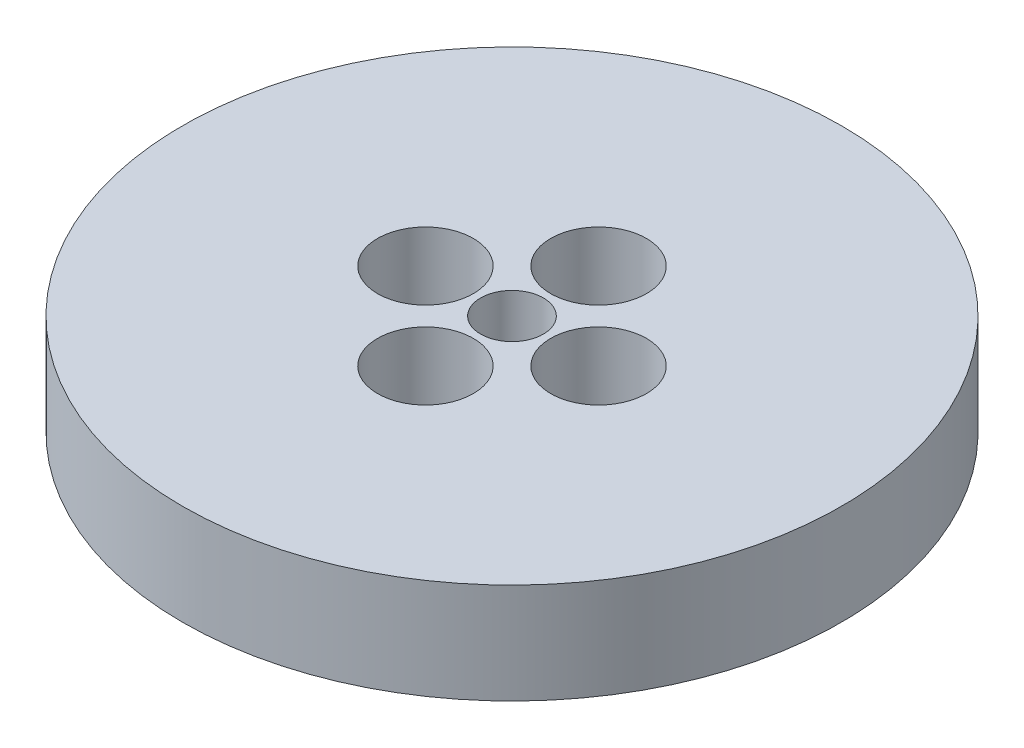
ISO-10303-21;
HEADER;
FILE_DESCRIPTION(('STEP AP214'),'2;1');
FILE_NAME('part.step','',(''),(''),'','','');
FILE_SCHEMA(('AUTOMOTIVE_DESIGN { 1 0 10303 214 1 1 1 1 }'));
ENDSEC;
DATA;
#1=APPLICATION_CONTEXT('core data for automotive mechanical design processes');
#2=APPLICATION_PROTOCOL_DEFINITION('international standard','automotive_design',2000,#1);
#3=PRODUCT_CONTEXT('',#1,'mechanical');
#4=PRODUCT('Part','Part','',(#3));
#5=PRODUCT_RELATED_PRODUCT_CATEGORY('part','',(#4));
#6=PRODUCT_DEFINITION_FORMATION('','',#4);
#7=PRODUCT_DEFINITION_CONTEXT('part definition',#1,'design');
#8=PRODUCT_DEFINITION('design','',#6,#7);
#9=PRODUCT_DEFINITION_SHAPE('','',#8);
#10=(LENGTH_UNIT() NAMED_UNIT(*) SI_UNIT(.MILLI.,.METRE.));
#11=(NAMED_UNIT(*) PLANE_ANGLE_UNIT() SI_UNIT($,.RADIAN.));
#12=(NAMED_UNIT(*) SI_UNIT($,.STERADIAN.) SOLID_ANGLE_UNIT());
#13=UNCERTAINTY_MEASURE_WITH_UNIT(LENGTH_MEASURE(1.E-05),#10,'distance_accuracy_value','');
#14=(GEOMETRIC_REPRESENTATION_CONTEXT(3) GLOBAL_UNCERTAINTY_ASSIGNED_CONTEXT((#13)) GLOBAL_UNIT_ASSIGNED_CONTEXT((#10,
#11,#12)) REPRESENTATION_CONTEXT('',''));
#15=CARTESIAN_POINT('',(0.,0.,0.));
#16=DIRECTION('',(0.,0.,1.));
#17=DIRECTION('',(1.,0.,0.));
#18=AXIS2_PLACEMENT_3D('',#15,#16,#17);
#19=CARTESIAN_POINT('',(0.,16.,0.));
#20=DIRECTION('',(0.,-1.,0.));
#21=DIRECTION('',(0.,0.,-1.));
#22=AXIS2_PLACEMENT_3D('',#19,#20,#21);
#23=CYLINDRICAL_SURFACE('',#22,52.5);
#24=CARTESIAN_POINT('',(0.,16.,0.));
#25=DIRECTION('',(0.,1.,0.));
#26=DIRECTION('',(0.,0.,1.));
#27=AXIS2_PLACEMENT_3D('',#24,#25,#26);
#28=CIRCLE('',#27,52.5);
#29=CARTESIAN_POINT('',(0.,16.,52.5));
#30=VERTEX_POINT('',#29);
#31=EDGE_CURVE('E10',#30,#30,#28,.T.);
#32=ORIENTED_EDGE('',*,*,#31,.F.);
#33=EDGE_LOOP('',(#32));
#34=FACE_BOUND('',#33,.T.);
#35=CARTESIAN_POINT('',(0.,0.,0.));
#36=DIRECTION('',(0.,1.,0.));
#37=DIRECTION('',(0.,0.,1.));
#38=AXIS2_PLACEMENT_3D('',#35,#36,#37);
#39=CIRCLE('',#38,52.5);
#40=CARTESIAN_POINT('',(0.,0.,52.5));
#41=VERTEX_POINT('',#40);
#42=EDGE_CURVE('E37',#41,#41,#39,.T.);
#43=ORIENTED_EDGE('',*,*,#42,.T.);
#44=EDGE_LOOP('',(#43));
#45=FACE_BOUND('',#44,.T.);
#46=ADVANCED_FACE('F40',(#34,#45),#23,.T.);
#47=CARTESIAN_POINT('',(0.,16.,0.));
#48=DIRECTION('',(0.,1.,0.));
#49=DIRECTION('',(0.,0.,1.));
#50=AXIS2_PLACEMENT_3D('',#47,#48,#49);
#51=PLANE('',#50);
#52=CARTESIAN_POINT('',(13.7886073295616,16.,0.));
#53=DIRECTION('',(0.,1.,0.));
#54=DIRECTION('',(0.,0.,-1.));
#55=AXIS2_PLACEMENT_3D('',#52,#53,#54);
#56=CIRCLE('',#55,7.62890674126943);
#57=CARTESIAN_POINT('',(13.7886073295616,16.,-7.62890674126943));
#58=VERTEX_POINT('',#57);
#59=EDGE_CURVE('E70',#58,#58,#56,.T.);
#60=ORIENTED_EDGE('',*,*,#59,.F.);
#61=EDGE_LOOP('',(#60));
#62=FACE_BOUND('',#61,.T.);
#63=CARTESIAN_POINT('',(-1.444279955394E-13,16.,-13.7886073295616));
#64=DIRECTION('',(0.,1.,0.));
#65=DIRECTION('',(-1.,0.,0.));
#66=AXIS2_PLACEMENT_3D('',#63,#64,#65);
#67=CIRCLE('',#66,7.62890674126943);
#68=CARTESIAN_POINT('',(-7.62890674126958,16.,-13.7886073295616));
#69=VERTEX_POINT('',#68);
#70=EDGE_CURVE('E71',#69,#69,#67,.T.);
#71=ORIENTED_EDGE('',*,*,#70,.F.);
#72=EDGE_LOOP('',(#71));
#73=FACE_BOUND('',#72,.T.);
#74=CARTESIAN_POINT('',(0.,16.,13.7886073295616));
#75=DIRECTION('',(0.,1.,0.));
#76=DIRECTION('',(1.,0.,0.));
#77=AXIS2_PLACEMENT_3D('',#74,#75,#76);
#78=CIRCLE('',#77,7.62890674126943);
#79=CARTESIAN_POINT('',(7.62890674126948,16.,13.7886073295616));
#80=VERTEX_POINT('',#79);
#81=EDGE_CURVE('E61',#80,#80,#78,.T.);
#82=ORIENTED_EDGE('',*,*,#81,.F.);
#83=EDGE_LOOP('',(#82));
#84=FACE_BOUND('',#83,.T.);
#85=CARTESIAN_POINT('',(-13.7886073295616,16.,0.));
#86=DIRECTION('',(0.,1.,0.));
#87=DIRECTION('',(0.,0.,1.));
#88=AXIS2_PLACEMENT_3D('',#85,#86,#87);
#89=CIRCLE('',#88,7.62890674126943);
#90=CARTESIAN_POINT('',(-13.7886073295616,16.,7.62890674126943));
#91=VERTEX_POINT('',#90);
#92=EDGE_CURVE('E54',#91,#91,#89,.T.);
#93=ORIENTED_EDGE('',*,*,#92,.F.);
#94=EDGE_LOOP('',(#93));
#95=FACE_BOUND('',#94,.T.);
#96=CARTESIAN_POINT('',(0.,16.,0.));
#97=DIRECTION('',(0.,1.,0.));
#98=DIRECTION('',(0.,0.,1.));
#99=AXIS2_PLACEMENT_3D('',#96,#97,#98);
#100=CIRCLE('',#99,5.);
#101=CARTESIAN_POINT('',(0.,16.,5.));
#102=VERTEX_POINT('',#101);
#103=EDGE_CURVE('E50',#102,#102,#100,.T.);
#104=ORIENTED_EDGE('',*,*,#103,.F.);
#105=EDGE_LOOP('',(#104));
#106=FACE_BOUND('',#105,.T.);
#107=ORIENTED_EDGE('',*,*,#31,.T.);
#108=EDGE_LOOP('',(#107));
#109=FACE_BOUND('',#108,.T.);
#110=ADVANCED_FACE('F86',(#62,#73,#84,#95,#106,#109),#51,.T.);
#111=CARTESIAN_POINT('',(0.,0.,0.));
#112=DIRECTION('',(0.,1.,0.));
#113=DIRECTION('',(0.,0.,1.));
#114=AXIS2_PLACEMENT_3D('',#111,#112,#113);
#115=PLANE('',#114);
#116=CARTESIAN_POINT('',(0.,0.,0.));
#117=DIRECTION('',(0.,1.,0.));
#118=DIRECTION('',(0.,0.,1.));
#119=AXIS2_PLACEMENT_3D('',#116,#117,#118);
#120=CIRCLE('',#119,5.);
#121=CARTESIAN_POINT('',(0.,0.,5.));
#122=VERTEX_POINT('',#121);
#123=EDGE_CURVE('E47',#122,#122,#120,.T.);
#124=ORIENTED_EDGE('',*,*,#123,.T.);
#125=EDGE_LOOP('',(#124));
#126=FACE_BOUND('',#125,.T.);
#127=ORIENTED_EDGE('',*,*,#42,.F.);
#128=EDGE_LOOP('',(#127));
#129=FACE_BOUND('',#128,.T.);
#130=ADVANCED_FACE('F93',(#126,#129),#115,.F.);
#131=CARTESIAN_POINT('',(0.,16.,0.));
#132=DIRECTION('',(0.,-1.,0.));
#133=DIRECTION('',(0.,0.,-1.));
#134=AXIS2_PLACEMENT_3D('',#131,#132,#133);
#135=CYLINDRICAL_SURFACE('',#134,5.);
#136=ORIENTED_EDGE('',*,*,#103,.T.);
#137=EDGE_LOOP('',(#136));
#138=FACE_BOUND('',#137,.T.);
#139=ORIENTED_EDGE('',*,*,#123,.F.);
#140=EDGE_LOOP('',(#139));
#141=FACE_BOUND('',#140,.T.);
#142=ADVANCED_FACE('F99',(#138,#141),#135,.F.);
#143=CARTESIAN_POINT('',(-13.7886073295616,0.763288180921912,0.));
#144=DIRECTION('',(0.,1.,0.));
#145=DIRECTION('',(0.,0.,1.));
#146=AXIS2_PLACEMENT_3D('',#143,#144,#145);
#147=CYLINDRICAL_SURFACE('',#146,7.62890674126943);
#148=CARTESIAN_POINT('',(-13.7886073295616,0.763288180921912,0.));
#149=DIRECTION('',(0.,1.,0.));
#150=DIRECTION('',(0.,0.,1.));
#151=AXIS2_PLACEMENT_3D('',#148,#149,#150);
#152=CIRCLE('',#151,7.62890674126943);
#153=CARTESIAN_POINT('',(-13.7886073295616,0.763288180921912,7.62890674126943));
#154=VERTEX_POINT('',#153);
#155=EDGE_CURVE('E55',#154,#154,#152,.T.);
#156=ORIENTED_EDGE('',*,*,#155,.F.);
#157=EDGE_LOOP('',(#156));
#158=FACE_BOUND('',#157,.T.);
#159=ORIENTED_EDGE('',*,*,#92,.T.);
#160=EDGE_LOOP('',(#159));
#161=FACE_BOUND('',#160,.T.);
#162=ADVANCED_FACE('F103',(#158,#161),#147,.F.);
#163=CARTESIAN_POINT('',(-13.7886073295616,0.763288180921912,0.));
#164=DIRECTION('',(0.,1.,0.));
#165=DIRECTION('',(0.,0.,1.));
#166=AXIS2_PLACEMENT_3D('',#163,#164,#165);
#167=PLANE('',#166);
#168=ORIENTED_EDGE('',*,*,#155,.T.);
#169=EDGE_LOOP('',(#168));
#170=FACE_BOUND('',#169,.T.);
#171=ADVANCED_FACE('F132',(#170),#167,.T.);
#172=CARTESIAN_POINT('',(0.,0.763288180921912,13.7886073295616));
#173=DIRECTION('',(0.,1.,0.));
#174=DIRECTION('',(0.,0.,1.));
#175=AXIS2_PLACEMENT_3D('',#172,#173,#174);
#176=CYLINDRICAL_SURFACE('',#175,7.62890674126943);
#177=CARTESIAN_POINT('',(0.,0.763288180921912,13.7886073295616));
#178=DIRECTION('',(0.,1.,0.));
#179=DIRECTION('',(1.,0.,0.));
#180=AXIS2_PLACEMENT_3D('',#177,#178,#179);
#181=CIRCLE('',#180,7.62890674126943);
#182=CARTESIAN_POINT('',(7.62890674126948,0.763288180921912,13.7886073295616));
#183=VERTEX_POINT('',#182);
#184=EDGE_CURVE('E59',#183,#183,#181,.T.);
#185=ORIENTED_EDGE('',*,*,#184,.F.);
#186=EDGE_LOOP('',(#185));
#187=FACE_BOUND('',#186,.T.);
#188=ORIENTED_EDGE('',*,*,#81,.T.);
#189=EDGE_LOOP('',(#188));
#190=FACE_BOUND('',#189,.T.);
#191=ADVANCED_FACE('F143',(#187,#190),#176,.F.);
#192=CARTESIAN_POINT('',(0.,0.763288180921912,13.7886073295616));
#193=DIRECTION('',(0.,1.,0.));
#194=DIRECTION('',(1.,0.,0.));
#195=AXIS2_PLACEMENT_3D('',#192,#193,#194);
#196=PLANE('',#195);
#197=ORIENTED_EDGE('',*,*,#184,.T.);
#198=EDGE_LOOP('',(#197));
#199=FACE_BOUND('',#198,.T.);
#200=ADVANCED_FACE('F83',(#199),#196,.T.);
#201=CARTESIAN_POINT('',(-1.444279955394E-13,0.763288180921912,-13.7886073295616));
#202=DIRECTION('',(0.,1.,0.));
#203=DIRECTION('',(0.,0.,1.));
#204=AXIS2_PLACEMENT_3D('',#201,#202,#203);
#205=CYLINDRICAL_SURFACE('',#204,7.62890674126943);
#206=CARTESIAN_POINT('',(-1.444279955394E-13,0.763288180921912,-13.7886073295616));
#207=DIRECTION('',(0.,1.,0.));
#208=DIRECTION('',(-1.,0.,0.));
#209=AXIS2_PLACEMENT_3D('',#206,#207,#208);
#210=CIRCLE('',#209,7.62890674126943);
#211=CARTESIAN_POINT('',(-7.62890674126958,0.763288180921912,-13.7886073295616));
#212=VERTEX_POINT('',#211);
#213=EDGE_CURVE('E69',#212,#212,#210,.T.);
#214=ORIENTED_EDGE('',*,*,#213,.F.);
#215=EDGE_LOOP('',(#214));
#216=FACE_BOUND('',#215,.T.);
#217=ORIENTED_EDGE('',*,*,#70,.T.);
#218=EDGE_LOOP('',(#217));
#219=FACE_BOUND('',#218,.T.);
#220=ADVANCED_FACE('F81',(#216,#219),#205,.F.);
#221=CARTESIAN_POINT('',(-1.444279955394E-13,0.763288180921912,-13.7886073295616));
#222=DIRECTION('',(0.,1.,0.));
#223=DIRECTION('',(-1.,0.,0.));
#224=AXIS2_PLACEMENT_3D('',#221,#222,#223);
#225=PLANE('',#224);
#226=ORIENTED_EDGE('',*,*,#213,.T.);
#227=EDGE_LOOP('',(#226));
#228=FACE_BOUND('',#227,.T.);
#229=ADVANCED_FACE('F78',(#228),#225,.T.);
#230=CARTESIAN_POINT('',(13.7886073295616,0.763288180921912,0.));
#231=DIRECTION('',(0.,1.,0.));
#232=DIRECTION('',(0.,0.,1.));
#233=AXIS2_PLACEMENT_3D('',#230,#231,#232);
#234=CYLINDRICAL_SURFACE('',#233,7.62890674126943);
#235=CARTESIAN_POINT('',(13.7886073295616,0.763288180921912,0.));
#236=DIRECTION('',(0.,1.,0.));
#237=DIRECTION('',(0.,0.,-1.));
#238=AXIS2_PLACEMENT_3D('',#235,#236,#237);
#239=CIRCLE('',#238,7.62890674126943);
#240=CARTESIAN_POINT('',(13.7886073295616,0.763288180921912,-7.62890674126943));
#241=VERTEX_POINT('',#240);
#242=EDGE_CURVE('E63',#241,#241,#239,.T.);
#243=ORIENTED_EDGE('',*,*,#242,.F.);
#244=EDGE_LOOP('',(#243));
#245=FACE_BOUND('',#244,.T.);
#246=ORIENTED_EDGE('',*,*,#59,.T.);
#247=EDGE_LOOP('',(#246));
#248=FACE_BOUND('',#247,.T.);
#249=ADVANCED_FACE('F176',(#245,#248),#234,.F.);
#250=CARTESIAN_POINT('',(13.7886073295616,0.763288180921912,0.));
#251=DIRECTION('',(0.,1.,0.));
#252=DIRECTION('',(0.,0.,-1.));
#253=AXIS2_PLACEMENT_3D('',#250,#251,#252);
#254=PLANE('',#253);
#255=ORIENTED_EDGE('',*,*,#242,.T.);
#256=EDGE_LOOP('',(#255));
#257=FACE_BOUND('',#256,.T.);
#258=ADVANCED_FACE('F184',(#257),#254,.T.);
#259=CLOSED_SHELL('',(#46,#110,#130,#142,#162,#171,#191,#200,#220,#229,#249,#258));
#260=MANIFOLD_SOLID_BREP('B2',#259);
#261=ADVANCED_BREP_SHAPE_REPRESENTATION('',(#18,#260),#14);
#262=SHAPE_DEFINITION_REPRESENTATION(#9,#261);
ENDSEC;
END-ISO-10303-21;
